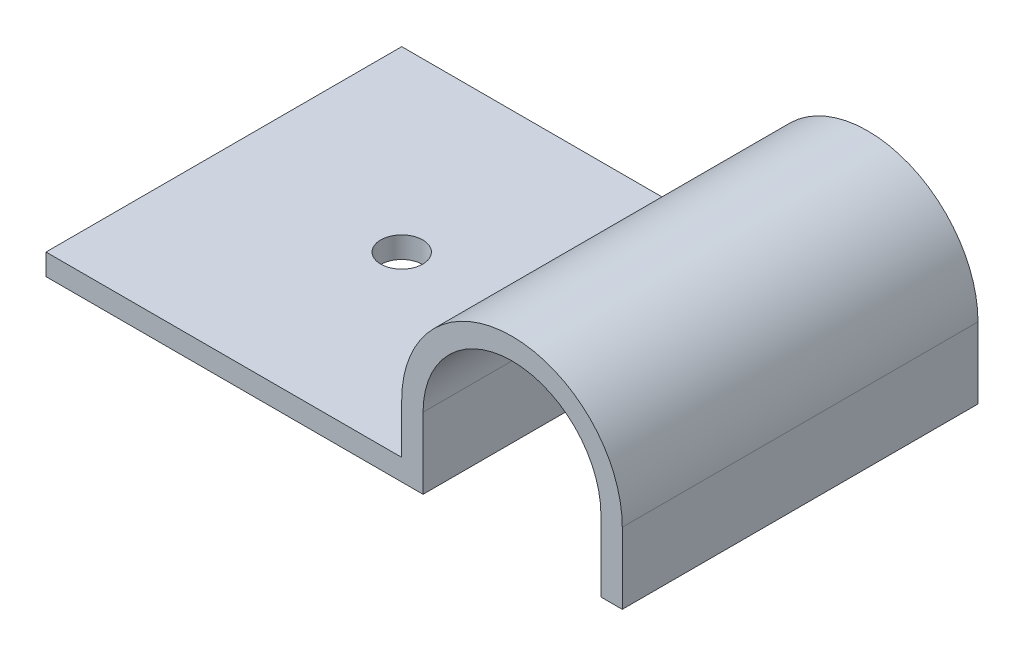
ISO-10303-21;
HEADER;
FILE_DESCRIPTION(('STEP AP214'),'2;1');
FILE_NAME('part.step','',(''),(''),'','','');
FILE_SCHEMA(('AUTOMOTIVE_DESIGN { 1 0 10303 214 1 1 1 1 }'));
ENDSEC;
DATA;
#1=APPLICATION_CONTEXT('core data for automotive mechanical design processes');
#2=APPLICATION_PROTOCOL_DEFINITION('international standard','automotive_design',2000,#1);
#3=PRODUCT_CONTEXT('',#1,'mechanical');
#4=PRODUCT('Part','Part','',(#3));
#5=PRODUCT_RELATED_PRODUCT_CATEGORY('part','',(#4));
#6=PRODUCT_DEFINITION_FORMATION('','',#4);
#7=PRODUCT_DEFINITION_CONTEXT('part definition',#1,'design');
#8=PRODUCT_DEFINITION('design','',#6,#7);
#9=PRODUCT_DEFINITION_SHAPE('','',#8);
#10=(LENGTH_UNIT() NAMED_UNIT(*) SI_UNIT(.MILLI.,.METRE.));
#11=(NAMED_UNIT(*) PLANE_ANGLE_UNIT() SI_UNIT($,.RADIAN.));
#12=(NAMED_UNIT(*) SI_UNIT($,.STERADIAN.) SOLID_ANGLE_UNIT());
#13=UNCERTAINTY_MEASURE_WITH_UNIT(LENGTH_MEASURE(1.E-05),#10,'distance_accuracy_value','');
#14=(GEOMETRIC_REPRESENTATION_CONTEXT(3) GLOBAL_UNCERTAINTY_ASSIGNED_CONTEXT((#13)) GLOBAL_UNIT_ASSIGNED_CONTEXT((#10,
#11,#12)) REPRESENTATION_CONTEXT('',''));
#15=CARTESIAN_POINT('',(0.,0.,0.));
#16=DIRECTION('',(0.,0.,1.));
#17=DIRECTION('',(1.,0.,0.));
#18=AXIS2_PLACEMENT_3D('',#15,#16,#17);
#19=CARTESIAN_POINT('',(-9.4615,2.8575,25.4));
#20=DIRECTION('',(-1.,0.,0.));
#21=DIRECTION('',(0.,0.,1.));
#22=AXIS2_PLACEMENT_3D('',#19,#20,#21);
#23=PLANE('',#22);
#24=DIRECTION('',(0.,1.,0.));
#25=VECTOR('',#24,1.);
#26=CARTESIAN_POINT('',(-9.4615,2.8575,0.));
#27=LINE('',#26,#25);
#28=CARTESIAN_POINT('',(-9.4615,4.3815,0.));
#29=VERTEX_POINT('',#28);
#30=CARTESIAN_POINT('',(-9.4615,7.9375,0.));
#31=VERTEX_POINT('',#30);
#32=EDGE_CURVE('E144',#29,#31,#27,.T.);
#33=ORIENTED_EDGE('',*,*,#32,.F.);
#34=DIRECTION('',(0.,0.,-1.));
#35=VECTOR('',#34,1.);
#36=CARTESIAN_POINT('',(-9.4615,4.3815,0.));
#37=LINE('',#36,#35);
#38=CARTESIAN_POINT('',(-9.4615,4.3815,25.4));
#39=VERTEX_POINT('',#38);
#40=EDGE_CURVE('E49',#39,#29,#37,.T.);
#41=ORIENTED_EDGE('',*,*,#40,.F.);
#42=DIRECTION('',(0.,1.,0.));
#43=VECTOR('',#42,1.);
#44=CARTESIAN_POINT('',(-9.4615,2.8575,25.4));
#45=LINE('',#44,#43);
#46=CARTESIAN_POINT('',(-9.4615,7.9375,25.4));
#47=VERTEX_POINT('',#46);
#48=EDGE_CURVE('E227',#39,#47,#45,.T.);
#49=ORIENTED_EDGE('',*,*,#48,.T.);
#50=DIRECTION('',(0.,0.,-1.));
#51=VECTOR('',#50,1.);
#52=CARTESIAN_POINT('',(-9.4615,7.9375,25.4));
#53=LINE('',#52,#51);
#54=EDGE_CURVE('E162',#47,#31,#53,.T.);
#55=ORIENTED_EDGE('',*,*,#54,.T.);
#56=EDGE_LOOP('',(#33,#41,#49,#55));
#57=FACE_BOUND('',#56,.T.);
#58=ADVANCED_FACE('F32',(#57),#23,.T.);
#59=CARTESIAN_POINT('',(-7.9375,7.9375,25.4));
#60=DIRECTION('',(1.,0.,0.));
#61=DIRECTION('',(0.,0.,-1.));
#62=AXIS2_PLACEMENT_3D('',#59,#60,#61);
#63=PLANE('',#62);
#64=DIRECTION('',(0.,-1.,0.));
#65=VECTOR('',#64,1.);
#66=CARTESIAN_POINT('',(-7.9375,7.9375,0.));
#67=LINE('',#66,#65);
#68=CARTESIAN_POINT('',(-7.9375,7.9375,0.));
#69=VERTEX_POINT('',#68);
#70=CARTESIAN_POINT('',(-7.9375,2.8575,0.));
#71=VERTEX_POINT('',#70);
#72=EDGE_CURVE('E137',#69,#71,#67,.T.);
#73=ORIENTED_EDGE('',*,*,#72,.F.);
#74=DIRECTION('',(0.,0.,-1.));
#75=VECTOR('',#74,1.);
#76=CARTESIAN_POINT('',(-7.9375,7.9375,25.4));
#77=LINE('',#76,#75);
#78=CARTESIAN_POINT('',(-7.9375,7.9375,25.4));
#79=VERTEX_POINT('',#78);
#80=EDGE_CURVE('E11',#79,#69,#77,.T.);
#81=ORIENTED_EDGE('',*,*,#80,.F.);
#82=DIRECTION('',(0.,-1.,0.));
#83=VECTOR('',#82,1.);
#84=CARTESIAN_POINT('',(-7.9375,7.9375,25.4));
#85=LINE('',#84,#83);
#86=CARTESIAN_POINT('',(-7.9375,2.8575,25.4));
#87=VERTEX_POINT('',#86);
#88=EDGE_CURVE('E157',#79,#87,#85,.T.);
#89=ORIENTED_EDGE('',*,*,#88,.T.);
#90=DIRECTION('',(0.,0.,-1.));
#91=VECTOR('',#90,1.);
#92=CARTESIAN_POINT('',(-7.9375,2.8575,25.4));
#93=LINE('',#92,#91);
#94=EDGE_CURVE('E36',#87,#71,#93,.T.);
#95=ORIENTED_EDGE('',*,*,#94,.T.);
#96=EDGE_LOOP('',(#73,#81,#89,#95));
#97=FACE_BOUND('',#96,.T.);
#98=ADVANCED_FACE('F34',(#97),#63,.T.);
#99=CARTESIAN_POINT('',(-1.5875,7.9375,25.4));
#100=DIRECTION('',(0.,0.,-1.));
#101=DIRECTION('',(-1.,0.,0.));
#102=AXIS2_PLACEMENT_3D('',#99,#100,#101);
#103=CYLINDRICAL_SURFACE('',#102,6.35);
#104=CARTESIAN_POINT('',(-1.5875,7.9375,0.));
#105=DIRECTION('',(0.,0.,1.));
#106=DIRECTION('',(1.,0.,0.));
#107=AXIS2_PLACEMENT_3D('',#104,#105,#106);
#108=CIRCLE('',#107,6.35);
#109=CARTESIAN_POINT('',(4.7625,7.9375,0.));
#110=VERTEX_POINT('',#109);
#111=EDGE_CURVE('E155',#110,#69,#108,.T.);
#112=ORIENTED_EDGE('',*,*,#111,.F.);
#113=DIRECTION('',(0.,0.,-1.));
#114=VECTOR('',#113,1.);
#115=CARTESIAN_POINT('',(4.7625,7.9375,25.4));
#116=LINE('',#115,#114);
#117=CARTESIAN_POINT('',(4.7625,7.9375,25.4));
#118=VERTEX_POINT('',#117);
#119=EDGE_CURVE('E41',#118,#110,#116,.T.);
#120=ORIENTED_EDGE('',*,*,#119,.F.);
#121=CARTESIAN_POINT('',(-1.5875,7.9375,25.4));
#122=DIRECTION('',(0.,0.,1.));
#123=DIRECTION('',(1.,0.,0.));
#124=AXIS2_PLACEMENT_3D('',#121,#122,#123);
#125=CIRCLE('',#124,6.35);
#126=EDGE_CURVE('E127',#118,#79,#125,.T.);
#127=ORIENTED_EDGE('',*,*,#126,.T.);
#128=ORIENTED_EDGE('',*,*,#80,.T.);
#129=EDGE_LOOP('',(#112,#120,#127,#128));
#130=FACE_BOUND('',#129,.T.);
#131=ADVANCED_FACE('F177',(#130),#103,.F.);
#132=CARTESIAN_POINT('',(4.7625,7.9375,25.4));
#133=DIRECTION('',(-1.,0.,0.));
#134=DIRECTION('',(0.,0.,1.));
#135=AXIS2_PLACEMENT_3D('',#132,#133,#134);
#136=PLANE('',#135);
#137=DIRECTION('',(0.,1.,0.));
#138=VECTOR('',#137,1.);
#139=CARTESIAN_POINT('',(4.7625,7.9375,0.));
#140=LINE('',#139,#138);
#141=CARTESIAN_POINT('',(4.7625,2.8575,0.));
#142=VERTEX_POINT('',#141);
#143=EDGE_CURVE('E114',#142,#110,#140,.T.);
#144=ORIENTED_EDGE('',*,*,#143,.F.);
#145=DIRECTION('',(0.,0.,-1.));
#146=VECTOR('',#145,1.);
#147=CARTESIAN_POINT('',(4.7625,2.8575,25.4));
#148=LINE('',#147,#146);
#149=CARTESIAN_POINT('',(4.7625,2.8575,25.4));
#150=VERTEX_POINT('',#149);
#151=EDGE_CURVE('E108',#150,#142,#148,.T.);
#152=ORIENTED_EDGE('',*,*,#151,.F.);
#153=DIRECTION('',(0.,1.,0.));
#154=VECTOR('',#153,1.);
#155=CARTESIAN_POINT('',(4.7625,7.9375,25.4));
#156=LINE('',#155,#154);
#157=EDGE_CURVE('E111',#150,#118,#156,.T.);
#158=ORIENTED_EDGE('',*,*,#157,.T.);
#159=ORIENTED_EDGE('',*,*,#119,.T.);
#160=EDGE_LOOP('',(#144,#152,#158,#159));
#161=FACE_BOUND('',#160,.T.);
#162=ADVANCED_FACE('F110',(#161),#136,.T.);
#163=CARTESIAN_POINT('',(6.2865,2.8575,25.4));
#164=DIRECTION('',(0.,-1.,0.));
#165=DIRECTION('',(0.,0.,-1.));
#166=AXIS2_PLACEMENT_3D('',#163,#164,#165);
#167=PLANE('',#166);
#168=DIRECTION('',(-1.,0.,0.));
#169=VECTOR('',#168,1.);
#170=CARTESIAN_POINT('',(6.2865,2.8575,0.));
#171=LINE('',#170,#169);
#172=CARTESIAN_POINT('',(6.2865,2.8575,0.));
#173=VERTEX_POINT('',#172);
#174=EDGE_CURVE('E152',#173,#142,#171,.T.);
#175=ORIENTED_EDGE('',*,*,#174,.F.);
#176=DIRECTION('',(0.,0.,-1.));
#177=VECTOR('',#176,1.);
#178=CARTESIAN_POINT('',(6.2865,2.8575,25.4));
#179=LINE('',#178,#177);
#180=CARTESIAN_POINT('',(6.2865,2.8575,25.4));
#181=VERTEX_POINT('',#180);
#182=EDGE_CURVE('E119',#181,#173,#179,.T.);
#183=ORIENTED_EDGE('',*,*,#182,.F.);
#184=DIRECTION('',(-1.,0.,0.));
#185=VECTOR('',#184,1.);
#186=CARTESIAN_POINT('',(6.2865,2.8575,25.4));
#187=LINE('',#186,#185);
#188=EDGE_CURVE('E125',#181,#150,#187,.T.);
#189=ORIENTED_EDGE('',*,*,#188,.T.);
#190=ORIENTED_EDGE('',*,*,#151,.T.);
#191=EDGE_LOOP('',(#175,#183,#189,#190));
#192=FACE_BOUND('',#191,.T.);
#193=ADVANCED_FACE('F129',(#192),#167,.T.);
#194=CARTESIAN_POINT('',(6.2865,7.9375,25.4));
#195=DIRECTION('',(1.,0.,0.));
#196=DIRECTION('',(0.,0.,-1.));
#197=AXIS2_PLACEMENT_3D('',#194,#195,#196);
#198=PLANE('',#197);
#199=DIRECTION('',(0.,-1.,0.));
#200=VECTOR('',#199,1.);
#201=CARTESIAN_POINT('',(6.2865,7.9375,0.));
#202=LINE('',#201,#200);
#203=CARTESIAN_POINT('',(6.2865,7.9375,0.));
#204=VERTEX_POINT('',#203);
#205=EDGE_CURVE('E149',#204,#173,#202,.T.);
#206=ORIENTED_EDGE('',*,*,#205,.F.);
#207=DIRECTION('',(0.,0.,-1.));
#208=VECTOR('',#207,1.);
#209=CARTESIAN_POINT('',(6.2865,7.9375,25.4));
#210=LINE('',#209,#208);
#211=CARTESIAN_POINT('',(6.2865,7.9375,25.4));
#212=VERTEX_POINT('',#211);
#213=EDGE_CURVE('E161',#212,#204,#210,.T.);
#214=ORIENTED_EDGE('',*,*,#213,.F.);
#215=DIRECTION('',(0.,-1.,0.));
#216=VECTOR('',#215,1.);
#217=CARTESIAN_POINT('',(6.2865,7.9375,25.4));
#218=LINE('',#217,#216);
#219=EDGE_CURVE('E130',#212,#181,#218,.T.);
#220=ORIENTED_EDGE('',*,*,#219,.T.);
#221=ORIENTED_EDGE('',*,*,#182,.T.);
#222=EDGE_LOOP('',(#206,#214,#220,#221));
#223=FACE_BOUND('',#222,.T.);
#224=ADVANCED_FACE('F200',(#223),#198,.T.);
#225=CARTESIAN_POINT('',(-1.5875,7.9375,25.4));
#226=DIRECTION('',(0.,0.,-1.));
#227=DIRECTION('',(-1.,0.,0.));
#228=AXIS2_PLACEMENT_3D('',#225,#226,#227);
#229=CYLINDRICAL_SURFACE('',#228,7.874);
#230=CARTESIAN_POINT('',(-1.5875,7.9375,0.));
#231=DIRECTION('',(0.,0.,-1.));
#232=DIRECTION('',(-1.,0.,0.));
#233=AXIS2_PLACEMENT_3D('',#230,#231,#232);
#234=CIRCLE('',#233,7.874);
#235=EDGE_CURVE('E146',#31,#204,#234,.T.);
#236=ORIENTED_EDGE('',*,*,#235,.F.);
#237=ORIENTED_EDGE('',*,*,#54,.F.);
#238=CARTESIAN_POINT('',(-1.5875,7.9375,25.4));
#239=DIRECTION('',(0.,0.,-1.));
#240=DIRECTION('',(-1.,0.,0.));
#241=AXIS2_PLACEMENT_3D('',#238,#239,#240);
#242=CIRCLE('',#241,7.874);
#243=EDGE_CURVE('E132',#47,#212,#242,.T.);
#244=ORIENTED_EDGE('',*,*,#243,.T.);
#245=ORIENTED_EDGE('',*,*,#213,.T.);
#246=EDGE_LOOP('',(#236,#237,#244,#245));
#247=FACE_BOUND('',#246,.T.);
#248=ADVANCED_FACE('F191',(#247),#229,.T.);
#249=CARTESIAN_POINT('',(-7.9375,2.8575,25.4));
#250=DIRECTION('',(0.,-1.,0.));
#251=DIRECTION('',(0.,0.,-1.));
#252=AXIS2_PLACEMENT_3D('',#249,#250,#251);
#253=PLANE('',#252);
#254=CARTESIAN_POINT('',(-22.1615,2.8575,12.7));
#255=DIRECTION('',(0.,-1.,0.));
#256=DIRECTION('',(0.,0.,-1.));
#257=AXIS2_PLACEMENT_3D('',#254,#255,#256);
#258=CIRCLE('',#257,1.5);
#259=CARTESIAN_POINT('',(-22.1615,2.8575,11.2));
#260=VERTEX_POINT('',#259);
#261=EDGE_CURVE('E204',#260,#260,#258,.T.);
#262=ORIENTED_EDGE('',*,*,#261,.F.);
#263=EDGE_LOOP('',(#262));
#264=FACE_BOUND('',#263,.T.);
#265=DIRECTION('',(-1.,0.,0.));
#266=VECTOR('',#265,1.);
#267=CARTESIAN_POINT('',(-7.9375,2.8575,0.));
#268=LINE('',#267,#266);
#269=CARTESIAN_POINT('',(-34.8615,2.8575,0.));
#270=VERTEX_POINT('',#269);
#271=EDGE_CURVE('E140',#71,#270,#268,.T.);
#272=ORIENTED_EDGE('',*,*,#271,.F.);
#273=ORIENTED_EDGE('',*,*,#94,.F.);
#274=DIRECTION('',(-1.,0.,0.));
#275=VECTOR('',#274,1.);
#276=CARTESIAN_POINT('',(-7.9375,2.8575,25.4));
#277=LINE('',#276,#275);
#278=CARTESIAN_POINT('',(-34.8615,2.8575,25.4));
#279=VERTEX_POINT('',#278);
#280=EDGE_CURVE('E225',#87,#279,#277,.T.);
#281=ORIENTED_EDGE('',*,*,#280,.T.);
#282=DIRECTION('',(0.,0.,1.));
#283=VECTOR('',#282,1.);
#284=CARTESIAN_POINT('',(-34.8615,2.8575,25.4));
#285=LINE('',#284,#283);
#286=EDGE_CURVE('E172',#270,#279,#285,.T.);
#287=ORIENTED_EDGE('',*,*,#286,.F.);
#288=EDGE_LOOP('',(#272,#273,#281,#287));
#289=FACE_BOUND('',#288,.T.);
#290=ADVANCED_FACE('F169',(#264,#289),#253,.T.);
#291=CARTESIAN_POINT('',(-1.5875,7.9375,25.4));
#292=DIRECTION('',(0.,0.,-1.));
#293=DIRECTION('',(-1.,0.,0.));
#294=AXIS2_PLACEMENT_3D('',#291,#292,#293);
#295=PLANE('',#294);
#296=ORIENTED_EDGE('',*,*,#88,.F.);
#297=ORIENTED_EDGE('',*,*,#126,.F.);
#298=ORIENTED_EDGE('',*,*,#157,.F.);
#299=ORIENTED_EDGE('',*,*,#188,.F.);
#300=ORIENTED_EDGE('',*,*,#219,.F.);
#301=ORIENTED_EDGE('',*,*,#243,.F.);
#302=ORIENTED_EDGE('',*,*,#48,.F.);
#303=DIRECTION('',(1.,0.,0.));
#304=VECTOR('',#303,1.);
#305=CARTESIAN_POINT('',(-34.8615,4.3815,25.4));
#306=LINE('',#305,#304);
#307=CARTESIAN_POINT('',(-34.8615,4.3815,25.4));
#308=VERTEX_POINT('',#307);
#309=EDGE_CURVE('E220',#308,#39,#306,.T.);
#310=ORIENTED_EDGE('',*,*,#309,.F.);
#311=DIRECTION('',(0.,1.,0.));
#312=VECTOR('',#311,1.);
#313=CARTESIAN_POINT('',(-34.8615,4.3815,25.4));
#314=LINE('',#313,#312);
#315=EDGE_CURVE('E218',#279,#308,#314,.T.);
#316=ORIENTED_EDGE('',*,*,#315,.F.);
#317=ORIENTED_EDGE('',*,*,#280,.F.);
#318=EDGE_LOOP('',(#296,#297,#298,#299,#300,#301,#302,#310,#316,#317));
#319=FACE_BOUND('',#318,.T.);
#320=ADVANCED_FACE('F123',(#319),#295,.F.);
#321=CARTESIAN_POINT('',(-1.5875,7.9375,0.));
#322=DIRECTION('',(0.,0.,-1.));
#323=DIRECTION('',(-1.,0.,0.));
#324=AXIS2_PLACEMENT_3D('',#321,#322,#323);
#325=PLANE('',#324);
#326=ORIENTED_EDGE('',*,*,#72,.T.);
#327=ORIENTED_EDGE('',*,*,#271,.T.);
#328=DIRECTION('',(0.,-1.,0.));
#329=VECTOR('',#328,1.);
#330=CARTESIAN_POINT('',(-34.8615,2.8575,0.));
#331=LINE('',#330,#329);
#332=CARTESIAN_POINT('',(-34.8615,4.3815,0.));
#333=VERTEX_POINT('',#332);
#334=EDGE_CURVE('E215',#333,#270,#331,.T.);
#335=ORIENTED_EDGE('',*,*,#334,.F.);
#336=DIRECTION('',(1.,0.,0.));
#337=VECTOR('',#336,1.);
#338=CARTESIAN_POINT('',(-34.8615,4.3815,0.));
#339=LINE('',#338,#337);
#340=EDGE_CURVE('E141',#333,#29,#339,.T.);
#341=ORIENTED_EDGE('',*,*,#340,.T.);
#342=ORIENTED_EDGE('',*,*,#32,.T.);
#343=ORIENTED_EDGE('',*,*,#235,.T.);
#344=ORIENTED_EDGE('',*,*,#205,.T.);
#345=ORIENTED_EDGE('',*,*,#174,.T.);
#346=ORIENTED_EDGE('',*,*,#143,.T.);
#347=ORIENTED_EDGE('',*,*,#111,.T.);
#348=EDGE_LOOP('',(#326,#327,#335,#341,#342,#343,#344,#345,#346,#347));
#349=FACE_BOUND('',#348,.T.);
#350=ADVANCED_FACE('F176',(#349),#325,.T.);
#351=CARTESIAN_POINT('',(-34.8615,4.3815,0.));
#352=DIRECTION('',(0.,-1.,0.));
#353=DIRECTION('',(0.,0.,-1.));
#354=AXIS2_PLACEMENT_3D('',#351,#352,#353);
#355=PLANE('',#354);
#356=CARTESIAN_POINT('',(-22.1615,4.3815,12.7));
#357=DIRECTION('',(0.,1.,0.));
#358=DIRECTION('',(0.,0.,1.));
#359=AXIS2_PLACEMENT_3D('',#356,#357,#358);
#360=CIRCLE('',#359,1.5);
#361=CARTESIAN_POINT('',(-22.1615,4.3815,14.2));
#362=VERTEX_POINT('',#361);
#363=EDGE_CURVE('E206',#362,#362,#360,.T.);
#364=ORIENTED_EDGE('',*,*,#363,.F.);
#365=EDGE_LOOP('',(#364));
#366=FACE_BOUND('',#365,.T.);
#367=ORIENTED_EDGE('',*,*,#40,.T.);
#368=ORIENTED_EDGE('',*,*,#340,.F.);
#369=DIRECTION('',(0.,0.,-1.));
#370=VECTOR('',#369,1.);
#371=CARTESIAN_POINT('',(-34.8615,4.3815,0.));
#372=LINE('',#371,#370);
#373=EDGE_CURVE('E208',#308,#333,#372,.T.);
#374=ORIENTED_EDGE('',*,*,#373,.F.);
#375=ORIENTED_EDGE('',*,*,#309,.T.);
#376=EDGE_LOOP('',(#367,#368,#374,#375));
#377=FACE_BOUND('',#376,.T.);
#378=ADVANCED_FACE('F243',(#366,#377),#355,.F.);
#379=CARTESIAN_POINT('',(-34.8615,0.,0.));
#380=DIRECTION('',(1.,0.,0.));
#381=DIRECTION('',(0.,0.,-1.));
#382=AXIS2_PLACEMENT_3D('',#379,#380,#381);
#383=PLANE('',#382);
#384=ORIENTED_EDGE('',*,*,#373,.T.);
#385=ORIENTED_EDGE('',*,*,#334,.T.);
#386=ORIENTED_EDGE('',*,*,#286,.T.);
#387=ORIENTED_EDGE('',*,*,#315,.T.);
#388=EDGE_LOOP('',(#384,#385,#386,#387));
#389=FACE_BOUND('',#388,.T.);
#390=ADVANCED_FACE('F242',(#389),#383,.F.);
#391=CARTESIAN_POINT('',(-22.1615,1.8415,12.7));
#392=DIRECTION('',(0.,1.,0.));
#393=DIRECTION('',(0.,0.,1.));
#394=AXIS2_PLACEMENT_3D('',#391,#392,#393);
#395=CYLINDRICAL_SURFACE('',#394,1.5);
#396=ORIENTED_EDGE('',*,*,#261,.T.);
#397=EDGE_LOOP('',(#396));
#398=FACE_BOUND('',#397,.T.);
#399=ORIENTED_EDGE('',*,*,#363,.T.);
#400=EDGE_LOOP('',(#399));
#401=FACE_BOUND('',#400,.T.);
#402=ADVANCED_FACE('F251',(#398,#401),#395,.F.);
#403=CLOSED_SHELL('',(#58,#98,#131,#162,#193,#224,#248,#290,#320,#350,#378,#390,#402));
#404=MANIFOLD_SOLID_BREP('B2',#403);
#405=ADVANCED_BREP_SHAPE_REPRESENTATION('',(#18,#404),#14);
#406=SHAPE_DEFINITION_REPRESENTATION(#9,#405);
ENDSEC;
END-ISO-10303-21;
